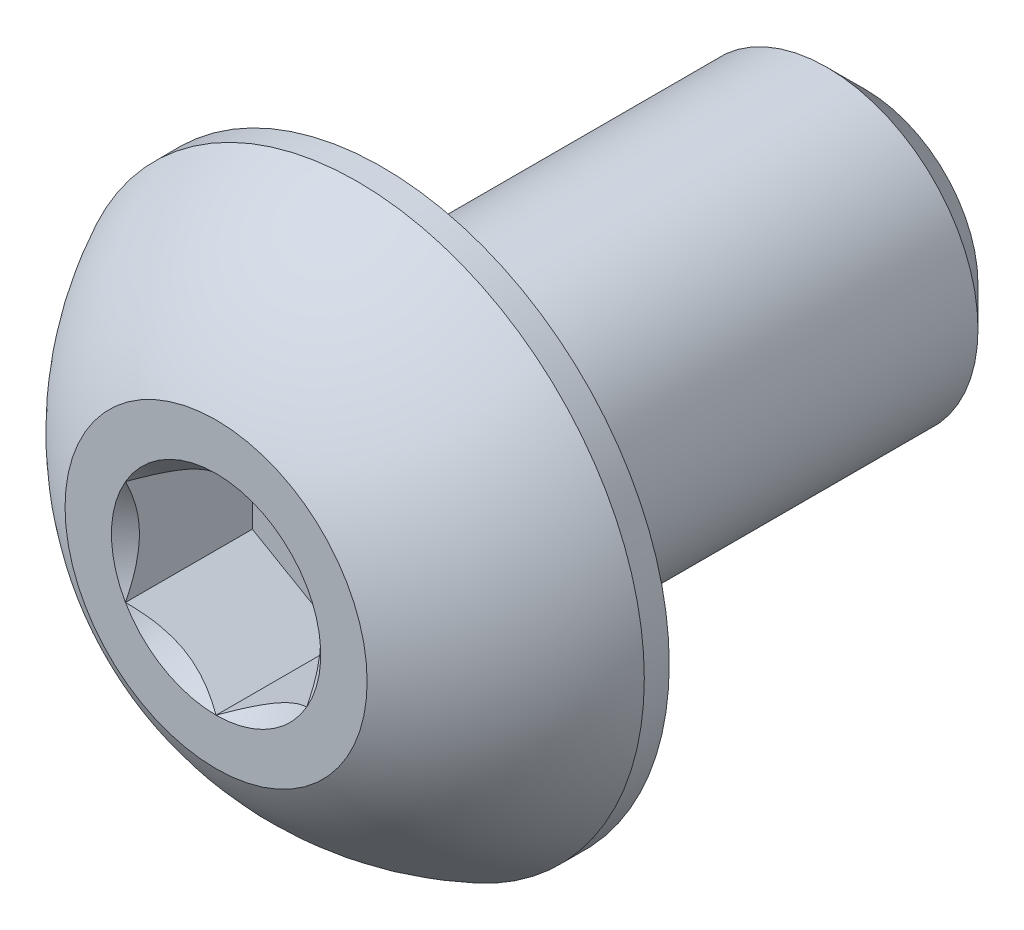
ISO-10303-21;
HEADER;
FILE_DESCRIPTION(('STEP AP214'),'2;1');
FILE_NAME('part.step','',(''),(''),'','','');
FILE_SCHEMA(('AUTOMOTIVE_DESIGN { 1 0 10303 214 1 1 1 1 }'));
ENDSEC;
DATA;
#1=APPLICATION_CONTEXT('core data for automotive mechanical design processes');
#2=APPLICATION_PROTOCOL_DEFINITION('international standard','automotive_design',2000,#1);
#3=PRODUCT_CONTEXT('',#1,'mechanical');
#4=PRODUCT('Part','Part','',(#3));
#5=PRODUCT_RELATED_PRODUCT_CATEGORY('part','',(#4));
#6=PRODUCT_DEFINITION_FORMATION('','',#4);
#7=PRODUCT_DEFINITION_CONTEXT('part definition',#1,'design');
#8=PRODUCT_DEFINITION('design','',#6,#7);
#9=PRODUCT_DEFINITION_SHAPE('','',#8);
#10=(LENGTH_UNIT() NAMED_UNIT(*) SI_UNIT(.MILLI.,.METRE.));
#11=(NAMED_UNIT(*) PLANE_ANGLE_UNIT() SI_UNIT($,.RADIAN.));
#12=(NAMED_UNIT(*) SI_UNIT($,.STERADIAN.) SOLID_ANGLE_UNIT());
#13=UNCERTAINTY_MEASURE_WITH_UNIT(LENGTH_MEASURE(1.E-05),#10,'distance_accuracy_value','');
#14=(GEOMETRIC_REPRESENTATION_CONTEXT(3) GLOBAL_UNCERTAINTY_ASSIGNED_CONTEXT((#13)) GLOBAL_UNIT_ASSIGNED_CONTEXT((#10,
#11,#12)) REPRESENTATION_CONTEXT('',''));
#15=CARTESIAN_POINT('',(0.,0.,0.));
#16=DIRECTION('',(0.,0.,1.));
#17=DIRECTION('',(1.,0.,0.));
#18=AXIS2_PLACEMENT_3D('',#15,#16,#17);
#19=CARTESIAN_POINT('',(0.,0.,5.375));
#20=DIRECTION('',(0.,0.,-1.));
#21=DIRECTION('',(-1.,0.,0.));
#22=AXIS2_PLACEMENT_3D('',#19,#20,#21);
#23=PLANE('',#22);
#24=CARTESIAN_POINT('',(0.,0.,5.375));
#25=DIRECTION('',(0.,0.,1.));
#26=DIRECTION('',(1.,0.,0.));
#27=AXIS2_PLACEMENT_3D('',#24,#25,#26);
#28=CIRCLE('',#27,1.73205080756888);
#29=CARTESIAN_POINT('',(-1.5,0.866025403784439,5.375));
#30=VERTEX_POINT('',#29);
#31=CARTESIAN_POINT('',(-1.5,-0.866025403784439,5.375));
#32=VERTEX_POINT('',#31);
#33=EDGE_CURVE('E130',#30,#32,#28,.T.);
#34=ORIENTED_EDGE('',*,*,#33,.F.);
#35=CARTESIAN_POINT('',(0.,1.73205080756888,5.375));
#36=VERTEX_POINT('',#35);
#37=EDGE_CURVE('E102',#36,#30,#28,.T.);
#38=ORIENTED_EDGE('',*,*,#37,.F.);
#39=CARTESIAN_POINT('',(1.5,0.866025403784439,5.375));
#40=VERTEX_POINT('',#39);
#41=EDGE_CURVE('E93',#40,#36,#28,.T.);
#42=ORIENTED_EDGE('',*,*,#41,.F.);
#43=CARTESIAN_POINT('',(1.5,-0.866025403784439,5.375));
#44=VERTEX_POINT('',#43);
#45=EDGE_CURVE('E54',#44,#40,#28,.T.);
#46=ORIENTED_EDGE('',*,*,#45,.F.);
#47=CARTESIAN_POINT('',(0.,-1.73205080756888,5.375));
#48=VERTEX_POINT('',#47);
#49=EDGE_CURVE('E61',#48,#44,#28,.T.);
#50=ORIENTED_EDGE('',*,*,#49,.F.);
#51=EDGE_CURVE('E131',#32,#48,#28,.T.);
#52=ORIENTED_EDGE('',*,*,#51,.F.);
#53=EDGE_LOOP('',(#34,#38,#42,#46,#50,#52));
#54=FACE_BOUND('',#53,.T.);
#55=CARTESIAN_POINT('',(0.,0.,5.375));
#56=DIRECTION('',(0.,0.,1.));
#57=DIRECTION('',(1.,0.,0.));
#58=AXIS2_PLACEMENT_3D('',#55,#56,#57);
#59=CIRCLE('',#58,2.5);
#60=CARTESIAN_POINT('',(0.,2.5,5.375));
#61=VERTEX_POINT('',#60);
#62=EDGE_CURVE('E48',#61,#61,#59,.T.);
#63=ORIENTED_EDGE('',*,*,#62,.T.);
#64=EDGE_LOOP('',(#63));
#65=FACE_BOUND('',#64,.T.);
#66=ADVANCED_FACE('F35',(#54,#65),#23,.F.);
#67=CARTESIAN_POINT('',(0.,0.,0.716945187165779));
#68=DIRECTION('',(0.,0.,1.));
#69=DIRECTION('',(0.,1.,0.));
#70=AXIS2_PLACEMENT_3D('',#67,#68,#69);
#71=SPHERICAL_SURFACE('',#70,5.28653711226622);
#72=CARTESIAN_POINT('',(0.,0.,3.0375));
#73=DIRECTION('',(0.,0.,1.));
#74=DIRECTION('',(1.,0.,0.));
#75=AXIS2_PLACEMENT_3D('',#72,#73,#74);
#76=CIRCLE('',#75,4.75);
#77=CARTESIAN_POINT('',(0.,4.75,3.0375));
#78=VERTEX_POINT('',#77);
#79=EDGE_CURVE('E213',#78,#78,#76,.T.);
#80=CARTESIAN_POINT('',(0.,2.5,5.375));
#81=CARTESIAN_POINT('',(0.,2.53026679982017,5.35875571754439));
#82=CARTESIAN_POINT('',(0.,2.56037522904968,5.34221635879359));
#83=CARTESIAN_POINT('',(0.,2.62026400427657,5.30855394811782));
#84=CARTESIAN_POINT('',(0.,2.65004435027396,5.29143089619285));
#85=CARTESIAN_POINT('',(0.,2.70926561698584,5.25660755858496));
#86=CARTESIAN_POINT('',(0.,2.73870653770032,5.23890727290205));
#87=CARTESIAN_POINT('',(0.,2.79723777417103,5.20293620595506));
#88=CARTESIAN_POINT('',(0.,2.82632808992726,5.18466542469098));
#89=CARTESIAN_POINT('',(0.,2.8841470610759,5.14756030560733));
#90=CARTESIAN_POINT('',(0.,2.91287571646831,5.12872596778776));
#91=CARTESIAN_POINT('',(0.,2.96996045130293,5.09050089302141));
#92=CARTESIAN_POINT('',(0.,2.99831653074515,5.07111015607464));
#93=CARTESIAN_POINT('',(0.,3.05464533901891,5.03177965075515));
#94=CARTESIAN_POINT('',(0.,3.08261806785047,5.01183988238244));
#95=CARTESIAN_POINT('',(0.,3.13816954607727,4.97141889083541));
#96=CARTESIAN_POINT('',(0.,3.16574829547251,4.9509376676611));
#97=CARTESIAN_POINT('',(0.,3.22050133565615,4.90944154879096));
#98=CARTESIAN_POINT('',(0.,3.24767562644455,4.88842665309514));
#99=CARTESIAN_POINT('',(0.,3.30160942393942,4.84587117426482));
#100=CARTESIAN_POINT('',(0.,3.32836893064589,4.82433059113032));
#101=CARTESIAN_POINT('',(0.,3.38146299210494,4.78073192224629));
#102=CARTESIAN_POINT('',(0.,3.40779754685753,4.75867383649676));
#103=CARTESIAN_POINT('',(0.,3.46003169800773,4.71404854384449));
#104=CARTESIAN_POINT('',(0.,3.48593129440535,4.69148133694177));
#105=CARTESIAN_POINT('',(0.,3.53728568771641,4.64584637689649));
#106=CARTESIAN_POINT('',(0.,3.56274048462986,4.62277862375395));
#107=CARTESIAN_POINT('',(0.,3.61319560685493,4.57615133633622));
#108=CARTESIAN_POINT('',(0.,3.63819593216655,4.55259180206105));
#109=CARTESIAN_POINT('',(0.,3.68773261175691,4.50498990434842));
#110=CARTESIAN_POINT('',(0.,3.71226896603565,4.48094754091097));
#111=CARTESIAN_POINT('',(0.,3.76086838042534,4.43238912030588));
#112=CARTESIAN_POINT('',(0.,3.78493144053629,4.40787306313825));
#113=CARTESIAN_POINT('',(0.,3.83257512329416,4.35837657049535));
#114=CARTESIAN_POINT('',(0.,3.85615574594108,4.33339613502009));
#115=CARTESIAN_POINT('',(0.,3.90282559378753,4.28298037763541));
#116=CARTESIAN_POINT('',(0.,3.92591481898706,4.25754505572599));
#117=CARTESIAN_POINT('',(0.,3.97159309867276,4.2062291901907));
#118=CARTESIAN_POINT('',(0.,3.99418215315894,4.18034864656483));
#119=CARTESIAN_POINT('',(0.,4.03885150820303,4.12815217148627));
#120=CARTESIAN_POINT('',(0.,4.06093180876093,4.10183624003358));
#121=CARTESIAN_POINT('',(0.,4.10457526604591,4.04877898862629));
#122=CARTESIAN_POINT('',(0.,4.12613842277298,4.0220376686717));
#123=CARTESIAN_POINT('',(0.,4.16873939899417,3.96813980122146));
#124=CARTESIAN_POINT('',(0.,4.1897772184883,3.94098325372581));
#125=CARTESIAN_POINT('',(0.,4.23131952645464,3.88626524992901));
#126=CARTESIAN_POINT('',(0.,4.25182401492686,3.85870379362786));
#127=CARTESIAN_POINT('',(0.,4.29229186971308,3.8031864448106));
#128=CARTESIAN_POINT('',(0.,4.31225523602708,3.7752305522945));
#129=CARTESIAN_POINT('',(0.,4.35163326096594,3.71893495350959));
#130=CARTESIAN_POINT('',(0.,4.3710479195908,3.6905952472408));
#131=CARTESIAN_POINT('',(0.,4.40932115213664,3.63354278926291));
#132=CARTESIAN_POINT('',(0.,4.42817972605762,3.60483003755382));
#133=CARTESIAN_POINT('',(0.,4.46533362339398,3.54704239871169));
#134=CARTESIAN_POINT('',(0.,4.48362894680934,3.51796751157864));
#135=CARTESIAN_POINT('',(0.,4.51964939166499,3.45946664966676));
#136=CARTESIAN_POINT('',(0.,4.53737451310527,3.43004067488792));
#137=CARTESIAN_POINT('',(0.,4.57224781803529,3.37084881826763));
#138=CARTESIAN_POINT('',(0.,4.58939600152503,3.34108293642618));
#139=CARTESIAN_POINT('',(0.,4.62310891815402,3.28122257765293));
#140=CARTESIAN_POINT('',(0.,4.63967365129327,3.25112810072113));
#141=CARTESIAN_POINT('',(0.,4.67221336026297,3.19062198025982));
#142=CARTESIAN_POINT('',(0.,4.68818833609342,3.16021033673031));
#143=CARTESIAN_POINT('',(0.,4.71954250823692,3.09908146319351));
#144=CARTESIAN_POINT('',(0.,4.73492170454996,3.06836423318622));
#145=CARTESIAN_POINT('',(0.,4.75,3.0375));
#146=B_SPLINE_CURVE_WITH_KNOTS('',3,(#80,#81,#82,#83,#84,#85,#86,#87,#88,#89,#90,#91,#92,#93,
#94,#95,#96,#97,#98,#99,#100,#101,#102,#103,#104,#105,#106,#107,#108,#109,#110,#111,#112,#113,
#114,#115,#116,#117,#118,#119,#120,#121,#122,#123,#124,#125,#126,#127,#128,#129,#130,#131,#132,
#133,#134,#135,#136,#137,#138,#139,#140,#141,#142,#143,#144,#145),.UNSPECIFIED.,.F.,.F.,(4,2,2,
2,2,2,2,2,2,2,2,2,2,2,2,2,2,2,2,2,2,2,2,2,2,2,2,2,2,2,2,2,4),(0.,0.103049823637829,
0.20609964727566,0.309149470913491,0.412199294551322,0.515249118189151,0.618298941826982,
0.721348765464812,0.824398589102642,0.927448412740474,1.0304982363783,1.13354806001613,
1.23659788365396,1.33964770729179,1.44269753092962,1.54574735456745,1.64879717820529,
1.75184700184312,1.85489682548095,1.95794664911878,2.06099647275661,2.16404629639444,
2.26709612003227,2.3701459436701,2.47319576730793,2.57624559094576,2.67929541458359,
2.78234523822142,2.88539506185925,2.98844488549708,3.09149470913491,3.19454453277274,
3.29759435641057),.UNSPECIFIED.);
#147=EDGE_CURVE('BSEAM218',#61,#78,#146,.T.);
#148=ORIENTED_EDGE('',*,*,#62,.F.);
#149=ORIENTED_EDGE('',*,*,#79,.T.);
#150=ORIENTED_EDGE('',*,*,#147,.T.);
#151=ORIENTED_EDGE('',*,*,#147,.F.);
#152=EDGE_LOOP('',(#148,#150,#149,#151));
#153=FACE_BOUND('',#152,.T.);
#154=ADVANCED_FACE('F218',(#153),#71,.T.);
#155=CARTESIAN_POINT('',(0.,0.,5.375));
#156=DIRECTION('',(0.,0.,1.));
#157=DIRECTION('',(1.,0.,0.));
#158=AXIS2_PLACEMENT_3D('',#155,#156,#157);
#159=CYLINDRICAL_SURFACE('',#158,4.75);
#160=ORIENTED_EDGE('',*,*,#79,.F.);
#161=EDGE_LOOP('',(#160));
#162=FACE_BOUND('',#161,.T.);
#163=CARTESIAN_POINT('',(0.,0.,2.625));
#164=DIRECTION('',(0.,0.,1.));
#165=DIRECTION('',(1.,0.,0.));
#166=AXIS2_PLACEMENT_3D('',#163,#164,#165);
#167=CIRCLE('',#166,4.75);
#168=CARTESIAN_POINT('',(4.75,0.,2.625));
#169=VERTEX_POINT('',#168);
#170=EDGE_CURVE('E210',#169,#169,#167,.T.);
#171=ORIENTED_EDGE('',*,*,#170,.T.);
#172=EDGE_LOOP('',(#171));
#173=FACE_BOUND('',#172,.T.);
#174=ADVANCED_FACE('F221',(#162,#173),#159,.T.);
#175=CARTESIAN_POINT('',(0.,2.5,2.625));
#176=DIRECTION('',(0.,0.,1.));
#177=DIRECTION('',(1.,0.,0.));
#178=AXIS2_PLACEMENT_3D('',#175,#176,#177);
#179=PLANE('',#178);
#180=ORIENTED_EDGE('',*,*,#170,.F.);
#181=EDGE_LOOP('',(#180));
#182=FACE_BOUND('',#181,.T.);
#183=CARTESIAN_POINT('',(0.,0.,2.625));
#184=DIRECTION('',(0.,0.,1.));
#185=DIRECTION('',(1.,0.,0.));
#186=AXIS2_PLACEMENT_3D('',#183,#184,#185);
#187=CIRCLE('',#186,2.5);
#188=CARTESIAN_POINT('',(2.5,0.,2.625));
#189=VERTEX_POINT('',#188);
#190=EDGE_CURVE('E207',#189,#189,#187,.T.);
#191=ORIENTED_EDGE('',*,*,#190,.T.);
#192=EDGE_LOOP('',(#191));
#193=FACE_BOUND('',#192,.T.);
#194=ADVANCED_FACE('F226',(#182,#193),#179,.F.);
#195=CARTESIAN_POINT('',(0.,0.,5.375));
#196=DIRECTION('',(0.,0.,1.));
#197=DIRECTION('',(1.,0.,0.));
#198=AXIS2_PLACEMENT_3D('',#195,#196,#197);
#199=CYLINDRICAL_SURFACE('',#198,2.5);
#200=ORIENTED_EDGE('',*,*,#190,.F.);
#201=EDGE_LOOP('',(#200));
#202=FACE_BOUND('',#201,.T.);
#203=CARTESIAN_POINT('',(0.,0.,-4.735));
#204=DIRECTION('',(0.,0.,1.));
#205=DIRECTION('',(1.,0.,0.));
#206=AXIS2_PLACEMENT_3D('',#203,#204,#205);
#207=CIRCLE('',#206,2.5);
#208=CARTESIAN_POINT('',(2.5,0.,-4.735));
#209=VERTEX_POINT('',#208);
#210=EDGE_CURVE('E204',#209,#209,#207,.T.);
#211=ORIENTED_EDGE('',*,*,#210,.T.);
#212=EDGE_LOOP('',(#211));
#213=FACE_BOUND('',#212,.T.);
#214=ADVANCED_FACE('F232',(#202,#213),#199,.T.);
#215=CARTESIAN_POINT('',(0.,0.,-5.375));
#216=DIRECTION('',(0.,0.,1.));
#217=DIRECTION('',(1.,0.,0.));
#218=AXIS2_PLACEMENT_3D('',#215,#216,#217);
#219=CONICAL_SURFACE('',#218,1.86000000000001,0.785398163397443);
#220=ORIENTED_EDGE('',*,*,#210,.F.);
#221=EDGE_LOOP('',(#220));
#222=FACE_BOUND('',#221,.T.);
#223=CARTESIAN_POINT('',(0.,0.,-5.375));
#224=DIRECTION('',(0.,0.,1.));
#225=DIRECTION('',(1.,0.,0.));
#226=AXIS2_PLACEMENT_3D('',#223,#224,#225);
#227=CIRCLE('',#226,1.86000000000001);
#228=CARTESIAN_POINT('',(1.86000000000001,0.,-5.375));
#229=VERTEX_POINT('',#228);
#230=EDGE_CURVE('E191',#229,#229,#227,.T.);
#231=ORIENTED_EDGE('',*,*,#230,.T.);
#232=EDGE_LOOP('',(#231));
#233=FACE_BOUND('',#232,.T.);
#234=ADVANCED_FACE('F238',(#222,#233),#219,.T.);
#235=CARTESIAN_POINT('',(0.,0.,-5.375));
#236=DIRECTION('',(0.,0.,1.));
#237=DIRECTION('',(1.,0.,0.));
#238=AXIS2_PLACEMENT_3D('',#235,#236,#237);
#239=PLANE('',#238);
#240=ORIENTED_EDGE('',*,*,#230,.F.);
#241=EDGE_LOOP('',(#240));
#242=FACE_BOUND('',#241,.T.);
#243=ADVANCED_FACE('F164',(#242),#239,.F.);
#244=CARTESIAN_POINT('',(0.,0.,5.375));
#245=DIRECTION('',(0.,0.,1.));
#246=DIRECTION('',(1.,0.,0.));
#247=AXIS2_PLACEMENT_3D('',#244,#245,#246);
#248=CONICAL_SURFACE('',#247,1.73205080756888,0.78539816339745);
#249=ORIENTED_EDGE('',*,*,#37,.T.);
#250=CARTESIAN_POINT('',(0.000199999999999762,1.73216627762272,5.37511548160007));
#251=CARTESIAN_POINT('',(-0.0513677907370759,1.70239359975915,5.34536547606733));
#252=CARTESIAN_POINT('',(-0.103797917665201,1.67212305186355,5.31736248391031));
#253=CARTESIAN_POINT('',(-0.210709034055597,1.61039789003619,5.26608923044014));
#254=CARTESIAN_POINT('',(-0.265200195814661,1.57893740312614,5.24284750504437));
#255=CARTESIAN_POINT('',(-0.375079081357249,1.51549879897987,5.20303372899222));
#256=CARTESIAN_POINT('',(-0.4304388090952,1.4835368452681,5.1863615856709));
#257=CARTESIAN_POINT('',(-0.54237725747715,1.41890915196211,5.1606744568181));
#258=CARTESIAN_POINT('',(-0.598952556553008,1.38624538781118,5.15164029047887));
#259=CARTESIAN_POINT('',(-0.696455389516441,1.329952100953,5.14348908122685));
#260=CARTESIAN_POINT('',(-0.737256908280466,1.30639533311124,5.14228225298922));
#261=CARTESIAN_POINT('',(-0.818787969615858,1.25932335290194,5.14431405716227));
#262=CARTESIAN_POINT('',(-0.85951749431463,1.23580815085313,5.14755367074831));
#263=CARTESIAN_POINT('',(-0.940584402163416,1.18900414978427,5.15829198598196));
#264=CARTESIAN_POINT('',(-0.980921384598288,1.1657155821172,5.16579465301873));
#265=CARTESIAN_POINT('',(-1.06091833691403,1.11952932016335,5.18465161192829));
#266=CARTESIAN_POINT('',(-1.10057800851621,1.09663179808786,5.19600755701859));
#267=CARTESIAN_POINT('',(-1.20216313477448,1.03798159809698,5.22972164759267));
#268=CARTESIAN_POINT('',(-1.26345855370969,1.00259267147465,5.25462184909337));
#269=CARTESIAN_POINT('',(-1.35358562846331,0.950557780604375,5.29665665327158));
#270=CARTESIAN_POINT('',(-1.38328513990772,0.933410759677148,5.3114251535591));
#271=CARTESIAN_POINT('',(-1.44213790138375,0.899432101996407,5.34231056594017));
#272=CARTESIAN_POINT('',(-1.47129140422064,0.882600319285711,5.35842683412171));
#273=CARTESIAN_POINT('',(-1.5002,0.865909933730602,5.37511548160007));
#274=B_SPLINE_CURVE_WITH_KNOTS('',3,(#250,#251,#252,#253,#254,#255,#256,#257,#258,#259,#260,
#261,#262,#263,#264,#265,#266,#267,#268,#269,#270,#271,#272,#273),.UNSPECIFIED.,.F.,.F.,(4,2,2,
2,2,2,2,2,2,2,2,4),(0.,0.199829143693305,0.400822987382388,0.59862372053818,0.795926240188888,
0.93711306795988,1.07833105577193,1.21968061668222,1.36109089931054,1.58570969637565,
1.69770705470964,1.80965120737194),.UNSPECIFIED.);
#275=EDGE_CURVE('E11',#36,#30,#274,.T.);
#276=ORIENTED_EDGE('',*,*,#275,.F.);
#277=EDGE_LOOP('',(#249,#276));
#278=FACE_BOUND('',#277,.T.);
#279=ADVANCED_FACE('F106',(#278),#248,.F.);
#280=ORIENTED_EDGE('',*,*,#33,.T.);
#281=CARTESIAN_POINT('',(-1.5,-1.72720812969692,5.93057851627079));
#282=CARTESIAN_POINT('',(-1.5,-1.68515175699268,5.89882990785743));
#283=CARTESIAN_POINT('',(-1.5,-1.64286104748673,5.86739259380738));
#284=CARTESIAN_POINT('',(-1.5,-1.55771581035942,5.80526908755641));
#285=CARTESIAN_POINT('',(-1.5,-1.51486114386668,5.7745830858922));
#286=CARTESIAN_POINT('',(-1.5,-1.3846813415127,5.68340719242716));
#287=CARTESIAN_POINT('',(-1.5,-1.29637976071654,5.62428834342677));
#288=CARTESIAN_POINT('',(-1.5,-1.11121478730467,5.5082309963165));
#289=CARTESIAN_POINT('',(-1.5,-1.01415038238167,5.45160955873301));
#290=CARTESIAN_POINT('',(-1.5,-0.815173408897605,5.34803688126565));
#291=CARTESIAN_POINT('',(-1.5,-0.713278669253285,5.30105304154167));
#292=CARTESIAN_POINT('',(-1.5,-0.560333774943111,5.24357266843083));
#293=CARTESIAN_POINT('',(-1.5,-0.511547982948042,5.22707538775725));
#294=CARTESIAN_POINT('',(-1.5,-0.412798620136866,5.19799751292701));
#295=CARTESIAN_POINT('',(-1.5,-0.362834968437562,5.18541718859402));
#296=CARTESIAN_POINT('',(-1.5,-0.262863235444981,5.16503619414677));
#297=CARTESIAN_POINT('',(-1.5,-0.212872113808022,5.15715363274598));
#298=CARTESIAN_POINT('',(-1.5,-0.112355243569545,5.146322063969));
#299=CARTESIAN_POINT('',(-1.5,-0.0618295883726273,5.14337220852435));
#300=CARTESIAN_POINT('',(-1.5,0.0374291733323846,5.14262485772485));
#301=CARTESIAN_POINT('',(-1.5,0.0861609672002995,5.14464473355808));
#302=CARTESIAN_POINT('',(-1.5,0.183206937768827,5.15332255289676));
#303=CARTESIAN_POINT('',(-1.5,0.231521073438269,5.15998094696846));
#304=CARTESIAN_POINT('',(-1.5,0.328199853425436,5.17768524412257));
#305=CARTESIAN_POINT('',(-1.5,0.376550616310328,5.18880581125704));
#306=CARTESIAN_POINT('',(-1.5,0.472195697125599,5.21484341404871));
#307=CARTESIAN_POINT('',(-1.5,0.519490103092741,5.22976013204094));
#308=CARTESIAN_POINT('',(-1.5,0.668391282696625,5.28233522359607));
#309=CARTESIAN_POINT('',(-1.5,0.767878709508553,5.32598128747198));
#310=CARTESIAN_POINT('',(-1.5,0.962179866690724,5.4230229945931));
#311=CARTESIAN_POINT('',(-1.5,1.05697519961444,5.47645366508953));
#312=CARTESIAN_POINT('',(-1.5,1.23814273533383,5.58668585200456));
#313=CARTESIAN_POINT('',(-1.5,1.3246994218129,5.6431879206986));
#314=CARTESIAN_POINT('',(-1.5,1.45222331290673,5.73053430157866));
#315=CARTESIAN_POINT('',(-1.5,1.49418091978756,5.75995775868004));
#316=CARTESIAN_POINT('',(-1.5,1.57752272931476,5.81958282183046));
#317=CARTESIAN_POINT('',(-1.5,1.61890708647354,5.84978421166444));
#318=CARTESIAN_POINT('',(-1.5,1.66005278019494,5.88030817860946));
#319=B_SPLINE_CURVE_WITH_KNOTS('',3,(#281,#282,#283,#284,#285,#286,#287,#288,#289,#290,#291,
#292,#293,#294,#295,#296,#297,#298,#299,#300,#301,#302,#303,#304,#305,#306,#307,#308,#309,#310,
#311,#312,#313,#314,#315,#316,#317,#318),.UNSPECIFIED.,.F.,.F.,(4,2,2,2,2,2,2,2,2,2,2,2,2,2,2,2,
2,2,4),(0.,0.158079548982669,0.316198780993942,0.634850417346958,0.971690311361509,
1.30737131660667,1.46173961127088,1.61611853740677,1.76772101421409,1.91929742368538,
2.065387412096,2.21149159305544,2.36014984633872,2.50879566386709,2.83376031422673,
3.15991186985652,3.46985601802197,3.62358896039974,3.7772796264207),.UNSPECIFIED.);
#320=EDGE_CURVE('E101',#30,#32,#319,.F.);
#321=ORIENTED_EDGE('',*,*,#320,.F.);
#322=EDGE_LOOP('',(#280,#321));
#323=FACE_BOUND('',#322,.T.);
#324=ADVANCED_FACE('F251',(#323),#248,.F.);
#325=ORIENTED_EDGE('',*,*,#51,.T.);
#326=CARTESIAN_POINT('',(-1.5002,-0.865909933730601,5.37511548160007));
#327=CARTESIAN_POINT('',(-1.44863220926292,-0.895682611594166,5.34536547606733));
#328=CARTESIAN_POINT('',(-1.3962020823348,-0.925953159489765,5.31736248391031));
#329=CARTESIAN_POINT('',(-1.2892909659444,-0.987678321317123,5.26608923044014));
#330=CARTESIAN_POINT('',(-1.23479980418534,-1.01913880822717,5.24284750504437));
#331=CARTESIAN_POINT('',(-1.12492091864275,-1.08257741237344,5.20303372899222));
#332=CARTESIAN_POINT('',(-1.0695611909048,-1.11453936608521,5.1863615856709));
#333=CARTESIAN_POINT('',(-0.957622742522849,-1.1791670593912,5.1606744568181));
#334=CARTESIAN_POINT('',(-0.901047443446991,-1.21183082354213,5.15164029047887));
#335=CARTESIAN_POINT('',(-0.803544610483559,-1.26812411040032,5.14348908122685));
#336=CARTESIAN_POINT('',(-0.762743091719534,-1.29168087824208,5.14228225298922));
#337=CARTESIAN_POINT('',(-0.681212030384142,-1.33875285845138,5.14431405716227));
#338=CARTESIAN_POINT('',(-0.64048250568537,-1.36226806050018,5.14755367074831));
#339=CARTESIAN_POINT('',(-0.559415597836584,-1.40907206156905,5.15829198598196));
#340=CARTESIAN_POINT('',(-0.519078615401712,-1.43236062923612,5.16579465301873));
#341=CARTESIAN_POINT('',(-0.439081663085969,-1.47854689118996,5.18465161192829));
#342=CARTESIAN_POINT('',(-0.399421991483792,-1.50144441326545,5.19600755701859));
#343=CARTESIAN_POINT('',(-0.297836865225515,-1.56009461325633,5.22972164759267));
#344=CARTESIAN_POINT('',(-0.236541446290311,-1.59548353987866,5.25462184909337));
#345=CARTESIAN_POINT('',(-0.146414371536686,-1.64751843074894,5.29665665327158));
#346=CARTESIAN_POINT('',(-0.116714860092282,-1.66466545167617,5.3114251535591));
#347=CARTESIAN_POINT('',(-0.057862098616249,-1.69864410935691,5.34231056594017));
#348=CARTESIAN_POINT('',(-0.0287085957793628,-1.71547589206761,5.35842683412171));
#349=CARTESIAN_POINT('',(0.000199999999999948,-1.73216627762272,5.37511548160007));
#350=B_SPLINE_CURVE_WITH_KNOTS('',3,(#326,#327,#328,#329,#330,#331,#332,#333,#334,#335,#336,
#337,#338,#339,#340,#341,#342,#343,#344,#345,#346,#347,#348,#349),.UNSPECIFIED.,.F.,.F.,(4,2,2,
2,2,2,2,2,2,2,2,4),(0.,0.199829143693305,0.400822987382388,0.59862372053818,0.795926240188889,
0.937113067959881,1.07833105577193,1.21968061668222,1.36109089931054,1.58570969637565,
1.69770705470964,1.80965120737194),.UNSPECIFIED.);
#351=EDGE_CURVE('E140',#32,#48,#350,.T.);
#352=ORIENTED_EDGE('',*,*,#351,.F.);
#353=EDGE_LOOP('',(#325,#352));
#354=FACE_BOUND('',#353,.T.);
#355=ADVANCED_FACE('F268',(#354),#248,.F.);
#356=ORIENTED_EDGE('',*,*,#49,.T.);
#357=CARTESIAN_POINT('',(-0.000200000000000055,-1.73216627762271,5.37511548160007));
#358=CARTESIAN_POINT('',(0.0513677907370757,-1.70239359975915,5.34536547606733));
#359=CARTESIAN_POINT('',(0.103797917665201,-1.67212305186355,5.31736248391031));
#360=CARTESIAN_POINT('',(0.210709034055597,-1.61039789003619,5.26608923044014));
#361=CARTESIAN_POINT('',(0.265200195814661,-1.57893740312614,5.24284750504437));
#362=CARTESIAN_POINT('',(0.375079081357248,-1.51549879897987,5.20303372899222));
#363=CARTESIAN_POINT('',(0.430438809095199,-1.4835368452681,5.1863615856709));
#364=CARTESIAN_POINT('',(0.54237725747715,-1.41890915196211,5.1606744568181));
#365=CARTESIAN_POINT('',(0.598952556553008,-1.38624538781118,5.15164029047887));
#366=CARTESIAN_POINT('',(0.69645538951644,-1.32995210095299,5.14348908122685));
#367=CARTESIAN_POINT('',(0.737256908280466,-1.30639533311124,5.14228225298922));
#368=CARTESIAN_POINT('',(0.818787969615858,-1.25932335290193,5.14431405716227));
#369=CARTESIAN_POINT('',(0.859517494314629,-1.23580815085313,5.14755367074831));
#370=CARTESIAN_POINT('',(0.940584402163416,-1.18900414978427,5.15829198598196));
#371=CARTESIAN_POINT('',(0.980921384598288,-1.1657155821172,5.16579465301873));
#372=CARTESIAN_POINT('',(1.06091833691403,-1.11952932016335,5.18465161192829));
#373=CARTESIAN_POINT('',(1.10057800851621,-1.09663179808786,5.19600755701859));
#374=CARTESIAN_POINT('',(1.20216313477448,-1.03798159809698,5.22972164759267));
#375=CARTESIAN_POINT('',(1.26345855370969,-1.00259267147465,5.25462184909337));
#376=CARTESIAN_POINT('',(1.35358562846331,-0.950557780604375,5.29665665327158));
#377=CARTESIAN_POINT('',(1.38328513990772,-0.933410759677148,5.3114251535591));
#378=CARTESIAN_POINT('',(1.44213790138375,-0.899432101996407,5.34231056594017));
#379=CARTESIAN_POINT('',(1.47129140422064,-0.88260031928571,5.35842683412171));
#380=CARTESIAN_POINT('',(1.5002,-0.865909933730601,5.37511548160007));
#381=B_SPLINE_CURVE_WITH_KNOTS('',3,(#357,#358,#359,#360,#361,#362,#363,#364,#365,#366,#367,
#368,#369,#370,#371,#372,#373,#374,#375,#376,#377,#378,#379,#380),.UNSPECIFIED.,.F.,.F.,(4,2,2,
2,2,2,2,2,2,2,2,4),(0.,0.199829143693305,0.400822987382388,0.59862372053818,0.795926240188889,
0.93711306795988,1.07833105577193,1.21968061668222,1.36109089931054,1.58570969637565,
1.69770705470963,1.80965120737194),.UNSPECIFIED.);
#382=EDGE_CURVE('E348',#48,#44,#381,.T.);
#383=ORIENTED_EDGE('',*,*,#382,.F.);
#384=EDGE_LOOP('',(#356,#383));
#385=FACE_BOUND('',#384,.T.);
#386=ADVANCED_FACE('F275',(#385),#248,.F.);
#387=ORIENTED_EDGE('',*,*,#45,.T.);
#388=CARTESIAN_POINT('',(1.5,-1.72720812969693,5.93057851627079));
#389=CARTESIAN_POINT('',(1.5,-1.68515175699268,5.89882990785743));
#390=CARTESIAN_POINT('',(1.5,-1.64286104748674,5.86739259380738));
#391=CARTESIAN_POINT('',(1.5,-1.55771581035942,5.80526908755641));
#392=CARTESIAN_POINT('',(1.5,-1.51486114386668,5.7745830858922));
#393=CARTESIAN_POINT('',(1.5,-1.3846813415127,5.68340719242716));
#394=CARTESIAN_POINT('',(1.5,-1.29637976071654,5.62428834342677));
#395=CARTESIAN_POINT('',(1.5,-1.11121478730467,5.50823099631651));
#396=CARTESIAN_POINT('',(1.5,-1.01415038238167,5.45160955873301));
#397=CARTESIAN_POINT('',(1.5,-0.815173408897606,5.34803688126565));
#398=CARTESIAN_POINT('',(1.5,-0.713278669253286,5.30105304154167));
#399=CARTESIAN_POINT('',(1.5,-0.560333774943112,5.24357266843083));
#400=CARTESIAN_POINT('',(1.5,-0.511547982948042,5.22707538775725));
#401=CARTESIAN_POINT('',(1.5,-0.412798620136867,5.19799751292701));
#402=CARTESIAN_POINT('',(1.5,-0.362834968437563,5.18541718859402));
#403=CARTESIAN_POINT('',(1.5,-0.262863235444982,5.16503619414677));
#404=CARTESIAN_POINT('',(1.5,-0.212872113808023,5.15715363274598));
#405=CARTESIAN_POINT('',(1.5,-0.112355243569545,5.146322063969));
#406=CARTESIAN_POINT('',(1.5,-0.061829588372628,5.14337220852435));
#407=CARTESIAN_POINT('',(1.5,0.0374291733323839,5.14262485772485));
#408=CARTESIAN_POINT('',(1.5,0.0861609672002987,5.14464473355808));
#409=CARTESIAN_POINT('',(1.5,0.183206937768827,5.15332255289676));
#410=CARTESIAN_POINT('',(1.5,0.231521073438269,5.15998094696846));
#411=CARTESIAN_POINT('',(1.5,0.328199853425435,5.17768524412257));
#412=CARTESIAN_POINT('',(1.5,0.376550616310327,5.18880581125704));
#413=CARTESIAN_POINT('',(1.5,0.472195697125598,5.21484341404871));
#414=CARTESIAN_POINT('',(1.5,0.51949010309274,5.22976013204094));
#415=CARTESIAN_POINT('',(1.5,0.668391282696624,5.28233522359607));
#416=CARTESIAN_POINT('',(1.5,0.767878709508552,5.32598128747198));
#417=CARTESIAN_POINT('',(1.5,0.962179866690723,5.4230229945931));
#418=CARTESIAN_POINT('',(1.5,1.05697519961444,5.47645366508953));
#419=CARTESIAN_POINT('',(1.5,1.23814273533383,5.58668585200456));
#420=CARTESIAN_POINT('',(1.5,1.3246994218129,5.6431879206986));
#421=CARTESIAN_POINT('',(1.5,1.45222331290673,5.73053430157866));
#422=CARTESIAN_POINT('',(1.5,1.49418091978756,5.75995775868004));
#423=CARTESIAN_POINT('',(1.5,1.57752272931476,5.81958282183046));
#424=CARTESIAN_POINT('',(1.5,1.61890708647354,5.84978421166444));
#425=CARTESIAN_POINT('',(1.5,1.66005278019494,5.88030817860946));
#426=B_SPLINE_CURVE_WITH_KNOTS('',3,(#388,#389,#390,#391,#392,#393,#394,#395,#396,#397,#398,
#399,#400,#401,#402,#403,#404,#405,#406,#407,#408,#409,#410,#411,#412,#413,#414,#415,#416,#417,
#418,#419,#420,#421,#422,#423,#424,#425),.UNSPECIFIED.,.F.,.F.,(4,2,2,2,2,2,2,2,2,2,2,2,2,2,2,2,
2,2,4),(0.,0.158079548982669,0.316198780993942,0.634850417346958,0.97169031136151,
1.30737131660667,1.46173961127089,1.61611853740677,1.7677210142141,1.91929742368538,
2.065387412096,2.21149159305544,2.36014984633872,2.50879566386709,2.83376031422673,
3.15991186985652,3.46985601802197,3.62358896039974,3.7772796264207),.UNSPECIFIED.);
#427=EDGE_CURVE('E118',#44,#40,#426,.T.);
#428=ORIENTED_EDGE('',*,*,#427,.F.);
#429=EDGE_LOOP('',(#387,#428));
#430=FACE_BOUND('',#429,.T.);
#431=ADVANCED_FACE('F282',(#430),#248,.F.);
#432=ORIENTED_EDGE('',*,*,#41,.T.);
#433=CARTESIAN_POINT('',(1.5002,0.865909933730601,5.37511548160007));
#434=CARTESIAN_POINT('',(1.44863220926292,0.895682611594166,5.34536547606733));
#435=CARTESIAN_POINT('',(1.3962020823348,0.925953159489765,5.31736248391031));
#436=CARTESIAN_POINT('',(1.2892909659444,0.987678321317124,5.26608923044014));
#437=CARTESIAN_POINT('',(1.23479980418534,1.01913880822717,5.24284750504437));
#438=CARTESIAN_POINT('',(1.12492091864275,1.08257741237344,5.20303372899222));
#439=CARTESIAN_POINT('',(1.0695611909048,1.11453936608521,5.1863615856709));
#440=CARTESIAN_POINT('',(0.957622742522849,1.1791670593912,5.1606744568181));
#441=CARTESIAN_POINT('',(0.901047443446991,1.21183082354213,5.15164029047887));
#442=CARTESIAN_POINT('',(0.803544610483559,1.26812411040032,5.14348908122685));
#443=CARTESIAN_POINT('',(0.762743091719533,1.29168087824208,5.14228225298922));
#444=CARTESIAN_POINT('',(0.681212030384141,1.33875285845138,5.14431405716227));
#445=CARTESIAN_POINT('',(0.64048250568537,1.36226806050018,5.14755367074831));
#446=CARTESIAN_POINT('',(0.559415597836584,1.40907206156905,5.15829198598196));
#447=CARTESIAN_POINT('',(0.519078615401711,1.43236062923612,5.16579465301873));
#448=CARTESIAN_POINT('',(0.439081663085969,1.47854689118996,5.18465161192829));
#449=CARTESIAN_POINT('',(0.399421991483792,1.50144441326545,5.19600755701859));
#450=CARTESIAN_POINT('',(0.297836865225515,1.56009461325633,5.22972164759267));
#451=CARTESIAN_POINT('',(0.236541446290311,1.59548353987866,5.25462184909337));
#452=CARTESIAN_POINT('',(0.146414371536686,1.64751843074894,5.29665665327158));
#453=CARTESIAN_POINT('',(0.116714860092282,1.66466545167617,5.3114251535591));
#454=CARTESIAN_POINT('',(0.0578620986162487,1.69864410935691,5.34231056594017));
#455=CARTESIAN_POINT('',(0.0287085957793624,1.71547589206761,5.35842683412171));
#456=CARTESIAN_POINT('',(-0.000200000000000159,1.73216627762272,5.37511548160007));
#457=B_SPLINE_CURVE_WITH_KNOTS('',3,(#433,#434,#435,#436,#437,#438,#439,#440,#441,#442,#443,
#444,#445,#446,#447,#448,#449,#450,#451,#452,#453,#454,#455,#456),.UNSPECIFIED.,.F.,.F.,(4,2,2,
2,2,2,2,2,2,2,2,4),(0.,0.199829143693304,0.400822987382389,0.598623720538181,0.795926240188889,
0.937113067959881,1.07833105577193,1.21968061668222,1.36109089931054,1.58570969637565,
1.69770705470964,1.80965120737194),.UNSPECIFIED.);
#458=EDGE_CURVE('E97',#40,#36,#457,.T.);
#459=ORIENTED_EDGE('',*,*,#458,.F.);
#460=EDGE_LOOP('',(#432,#459));
#461=FACE_BOUND('',#460,.T.);
#462=ADVANCED_FACE('F95',(#461),#248,.F.);
#463=CARTESIAN_POINT('',(0.,0.,3.275));
#464=DIRECTION('',(0.,0.,1.));
#465=DIRECTION('',(1.,0.,0.));
#466=AXIS2_PLACEMENT_3D('',#463,#464,#465);
#467=PLANE('',#466);
#468=DIRECTION('',(-0.866025403784439,0.5,0.));
#469=VECTOR('',#468,1.);
#470=CARTESIAN_POINT('',(1.5,0.866025403784439,3.275));
#471=LINE('',#470,#469);
#472=CARTESIAN_POINT('',(1.5,0.866025403784439,3.275));
#473=VERTEX_POINT('',#472);
#474=CARTESIAN_POINT('',(0.,1.73205080756888,3.275));
#475=VERTEX_POINT('',#474);
#476=EDGE_CURVE('E117',#473,#475,#471,.T.);
#477=ORIENTED_EDGE('',*,*,#476,.T.);
#478=DIRECTION('',(-0.866025403784439,-0.5,0.));
#479=VECTOR('',#478,1.);
#480=CARTESIAN_POINT('',(0.,1.73205080756888,3.275));
#481=LINE('',#480,#479);
#482=CARTESIAN_POINT('',(-1.5,0.866025403784439,3.275));
#483=VERTEX_POINT('',#482);
#484=EDGE_CURVE('E122',#475,#483,#481,.T.);
#485=ORIENTED_EDGE('',*,*,#484,.T.);
#486=DIRECTION('',(0.,-1.,0.));
#487=VECTOR('',#486,1.);
#488=CARTESIAN_POINT('',(-1.5,0.866025403784439,3.275));
#489=LINE('',#488,#487);
#490=CARTESIAN_POINT('',(-1.5,-0.866025403784438,3.275));
#491=VERTEX_POINT('',#490);
#492=EDGE_CURVE('E179',#483,#491,#489,.T.);
#493=ORIENTED_EDGE('',*,*,#492,.T.);
#494=DIRECTION('',(0.866025403784439,-0.5,0.));
#495=VECTOR('',#494,1.);
#496=CARTESIAN_POINT('',(-1.5,-0.866025403784438,3.275));
#497=LINE('',#496,#495);
#498=CARTESIAN_POINT('',(0.,-1.73205080756888,3.275));
#499=VERTEX_POINT('',#498);
#500=EDGE_CURVE('E182',#491,#499,#497,.T.);
#501=ORIENTED_EDGE('',*,*,#500,.T.);
#502=DIRECTION('',(0.866025403784439,0.5,0.));
#503=VECTOR('',#502,1.);
#504=CARTESIAN_POINT('',(0.,-1.73205080756888,3.275));
#505=LINE('',#504,#503);
#506=CARTESIAN_POINT('',(1.5,-0.866025403784439,3.275));
#507=VERTEX_POINT('',#506);
#508=EDGE_CURVE('E185',#499,#507,#505,.T.);
#509=ORIENTED_EDGE('',*,*,#508,.T.);
#510=DIRECTION('',(0.,1.,0.));
#511=VECTOR('',#510,1.);
#512=CARTESIAN_POINT('',(1.5,-0.866025403784439,3.275));
#513=LINE('',#512,#511);
#514=EDGE_CURVE('E125',#507,#473,#513,.T.);
#515=ORIENTED_EDGE('',*,*,#514,.T.);
#516=EDGE_LOOP('',(#477,#485,#493,#501,#509,#515));
#517=FACE_BOUND('',#516,.T.);
#518=ADVANCED_FACE('F159',(#517),#467,.T.);
#519=CARTESIAN_POINT('',(0.,1.73205080756888,3.275));
#520=DIRECTION('',(-0.5,0.866025403784439,0.));
#521=DIRECTION('',(-0.866025403784439,-0.5,0.));
#522=AXIS2_PLACEMENT_3D('',#519,#520,#521);
#523=PLANE('',#522);
#524=DIRECTION('',(0.,0.,1.));
#525=VECTOR('',#524,1.);
#526=CARTESIAN_POINT('',(0.,1.73205080756888,3.275));
#527=LINE('',#526,#525);
#528=EDGE_CURVE('E114',#475,#36,#527,.T.);
#529=ORIENTED_EDGE('',*,*,#528,.T.);
#530=ORIENTED_EDGE('',*,*,#275,.T.);
#531=DIRECTION('',(0.,0.,1.));
#532=VECTOR('',#531,1.);
#533=CARTESIAN_POINT('',(-1.5,0.866025403784439,3.275));
#534=LINE('',#533,#532);
#535=EDGE_CURVE('E124',#483,#30,#534,.T.);
#536=ORIENTED_EDGE('',*,*,#535,.F.);
#537=ORIENTED_EDGE('',*,*,#484,.F.);
#538=EDGE_LOOP('',(#529,#530,#536,#537));
#539=FACE_BOUND('',#538,.T.);
#540=ADVANCED_FACE('F120',(#539),#523,.F.);
#541=CARTESIAN_POINT('',(-1.5,0.866025403784439,3.275));
#542=DIRECTION('',(-1.,0.,0.));
#543=DIRECTION('',(0.,0.,1.));
#544=AXIS2_PLACEMENT_3D('',#541,#542,#543);
#545=PLANE('',#544);
#546=ORIENTED_EDGE('',*,*,#535,.T.);
#547=ORIENTED_EDGE('',*,*,#320,.T.);
#548=DIRECTION('',(0.,0.,1.));
#549=VECTOR('',#548,1.);
#550=CARTESIAN_POINT('',(-1.5,-0.866025403784438,3.275));
#551=LINE('',#550,#549);
#552=EDGE_CURVE('E198',#491,#32,#551,.T.);
#553=ORIENTED_EDGE('',*,*,#552,.F.);
#554=ORIENTED_EDGE('',*,*,#492,.F.);
#555=EDGE_LOOP('',(#546,#547,#553,#554));
#556=FACE_BOUND('',#555,.T.);
#557=ADVANCED_FACE('F149',(#556),#545,.F.);
#558=CARTESIAN_POINT('',(-1.5,-0.866025403784438,3.275));
#559=DIRECTION('',(-0.5,-0.866025403784439,0.));
#560=DIRECTION('',(0.866025403784439,-0.5,0.));
#561=AXIS2_PLACEMENT_3D('',#558,#559,#560);
#562=PLANE('',#561);
#563=ORIENTED_EDGE('',*,*,#552,.T.);
#564=ORIENTED_EDGE('',*,*,#351,.T.);
#565=DIRECTION('',(0.,0.,1.));
#566=VECTOR('',#565,1.);
#567=CARTESIAN_POINT('',(0.,-1.73205080756888,3.275));
#568=LINE('',#567,#566);
#569=EDGE_CURVE('E195',#499,#48,#568,.T.);
#570=ORIENTED_EDGE('',*,*,#569,.F.);
#571=ORIENTED_EDGE('',*,*,#500,.F.);
#572=EDGE_LOOP('',(#563,#564,#570,#571));
#573=FACE_BOUND('',#572,.T.);
#574=ADVANCED_FACE('F152',(#573),#562,.F.);
#575=CARTESIAN_POINT('',(0.,-1.73205080756888,3.275));
#576=DIRECTION('',(0.5,-0.866025403784439,0.));
#577=DIRECTION('',(0.866025403784439,0.5,0.));
#578=AXIS2_PLACEMENT_3D('',#575,#576,#577);
#579=PLANE('',#578);
#580=ORIENTED_EDGE('',*,*,#569,.T.);
#581=ORIENTED_EDGE('',*,*,#382,.T.);
#582=DIRECTION('',(0.,0.,1.));
#583=VECTOR('',#582,1.);
#584=CARTESIAN_POINT('',(1.5,-0.866025403784439,3.275));
#585=LINE('',#584,#583);
#586=EDGE_CURVE('E192',#507,#44,#585,.T.);
#587=ORIENTED_EDGE('',*,*,#586,.F.);
#588=ORIENTED_EDGE('',*,*,#508,.F.);
#589=EDGE_LOOP('',(#580,#581,#587,#588));
#590=FACE_BOUND('',#589,.T.);
#591=ADVANCED_FACE('F306',(#590),#579,.F.);
#592=CARTESIAN_POINT('',(1.5,-0.866025403784439,3.275));
#593=DIRECTION('',(1.,0.,0.));
#594=DIRECTION('',(0.,1.,0.));
#595=AXIS2_PLACEMENT_3D('',#592,#593,#594);
#596=PLANE('',#595);
#597=ORIENTED_EDGE('',*,*,#586,.T.);
#598=ORIENTED_EDGE('',*,*,#427,.T.);
#599=DIRECTION('',(0.,0.,1.));
#600=VECTOR('',#599,1.);
#601=CARTESIAN_POINT('',(1.5,0.866025403784439,3.275));
#602=LINE('',#601,#600);
#603=EDGE_CURVE('E116',#473,#40,#602,.T.);
#604=ORIENTED_EDGE('',*,*,#603,.F.);
#605=ORIENTED_EDGE('',*,*,#514,.F.);
#606=EDGE_LOOP('',(#597,#598,#604,#605));
#607=FACE_BOUND('',#606,.T.);
#608=ADVANCED_FACE('F163',(#607),#596,.F.);
#609=CARTESIAN_POINT('',(1.5,0.866025403784439,3.275));
#610=DIRECTION('',(0.5,0.866025403784439,0.));
#611=DIRECTION('',(-0.866025403784439,0.5,0.));
#612=AXIS2_PLACEMENT_3D('',#609,#610,#611);
#613=PLANE('',#612);
#614=ORIENTED_EDGE('',*,*,#603,.T.);
#615=ORIENTED_EDGE('',*,*,#458,.T.);
#616=ORIENTED_EDGE('',*,*,#528,.F.);
#617=ORIENTED_EDGE('',*,*,#476,.F.);
#618=EDGE_LOOP('',(#614,#615,#616,#617));
#619=FACE_BOUND('',#618,.T.);
#620=ADVANCED_FACE('F112',(#619),#613,.F.);
#621=CLOSED_SHELL('',(#66,#154,#174,#194,#214,#234,#243,#279,#324,#355,#386,#431,#462,#518,#540,
#557,#574,#591,#608,#620));
#622=MANIFOLD_SOLID_BREP('B2',#621);
#623=ADVANCED_BREP_SHAPE_REPRESENTATION('',(#18,#622),#14);
#624=SHAPE_DEFINITION_REPRESENTATION(#9,#623);
ENDSEC;
END-ISO-10303-21;
